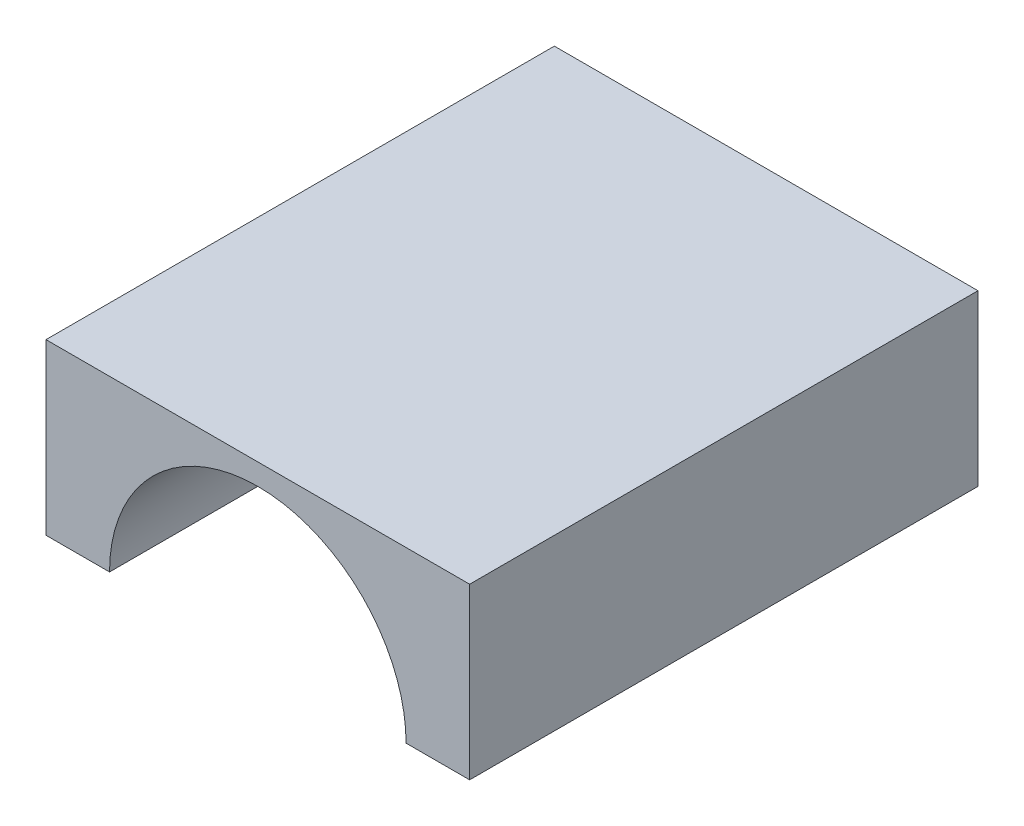
ISO-10303-21;
HEADER;
FILE_DESCRIPTION(('STEP AP214'),'2;1');
FILE_NAME('part.step','',(''),(''),'','','');
FILE_SCHEMA(('AUTOMOTIVE_DESIGN { 1 0 10303 214 1 1 1 1 }'));
ENDSEC;
DATA;
#1=APPLICATION_CONTEXT('core data for automotive mechanical design processes');
#2=APPLICATION_PROTOCOL_DEFINITION('international standard','automotive_design',2000,#1);
#3=PRODUCT_CONTEXT('',#1,'mechanical');
#4=PRODUCT('Part','Part','',(#3));
#5=PRODUCT_RELATED_PRODUCT_CATEGORY('part','',(#4));
#6=PRODUCT_DEFINITION_FORMATION('','',#4);
#7=PRODUCT_DEFINITION_CONTEXT('part definition',#1,'design');
#8=PRODUCT_DEFINITION('design','',#6,#7);
#9=PRODUCT_DEFINITION_SHAPE('','',#8);
#10=(LENGTH_UNIT() NAMED_UNIT(*) SI_UNIT(.MILLI.,.METRE.));
#11=(NAMED_UNIT(*) PLANE_ANGLE_UNIT() SI_UNIT($,.RADIAN.));
#12=(NAMED_UNIT(*) SI_UNIT($,.STERADIAN.) SOLID_ANGLE_UNIT());
#13=UNCERTAINTY_MEASURE_WITH_UNIT(LENGTH_MEASURE(1.E-05),#10,'distance_accuracy_value','');
#14=(GEOMETRIC_REPRESENTATION_CONTEXT(3) GLOBAL_UNCERTAINTY_ASSIGNED_CONTEXT((#13)) GLOBAL_UNIT_ASSIGNED_CONTEXT((#10,
#11,#12)) REPRESENTATION_CONTEXT('',''));
#15=CARTESIAN_POINT('',(0.,0.,0.));
#16=DIRECTION('',(0.,0.,1.));
#17=DIRECTION('',(1.,0.,0.));
#18=AXIS2_PLACEMENT_3D('',#15,#16,#17);
#19=CARTESIAN_POINT('',(0.,0.,0.));
#20=DIRECTION('',(0.,-1.,0.));
#21=DIRECTION('',(0.,0.,-1.));
#22=AXIS2_PLACEMENT_3D('',#19,#20,#21);
#23=PLANE('',#22);
#24=DIRECTION('',(0.,0.,-1.));
#25=VECTOR('',#24,1.);
#26=CARTESIAN_POINT('',(-7.,0.,-10.));
#27=LINE('',#26,#25);
#28=CARTESIAN_POINT('',(-7.,0.,-10.));
#29=VERTEX_POINT('',#28);
#30=CARTESIAN_POINT('',(-7.,0.,-12.));
#31=VERTEX_POINT('',#30);
#32=EDGE_CURVE('E192',#29,#31,#27,.T.);
#33=ORIENTED_EDGE('',*,*,#32,.F.);
#34=DIRECTION('',(0.,0.,1.));
#35=VECTOR('',#34,1.);
#36=CARTESIAN_POINT('',(-7.,0.,-10.));
#37=LINE('',#36,#35);
#38=CARTESIAN_POINT('',(-7.,0.,12.));
#39=VERTEX_POINT('',#38);
#40=EDGE_CURVE('E48',#39,#29,#37,.F.);
#41=ORIENTED_EDGE('',*,*,#40,.F.);
#42=DIRECTION('',(1.,0.,0.));
#43=VECTOR('',#42,1.);
#44=CARTESIAN_POINT('',(-10.,0.,12.));
#45=LINE('',#44,#43);
#46=CARTESIAN_POINT('',(-10.,0.,12.));
#47=VERTEX_POINT('',#46);
#48=EDGE_CURVE('E205',#47,#39,#45,.T.);
#49=ORIENTED_EDGE('',*,*,#48,.F.);
#50=DIRECTION('',(0.,0.,1.));
#51=VECTOR('',#50,1.);
#52=CARTESIAN_POINT('',(-10.,0.,12.));
#53=LINE('',#52,#51);
#54=CARTESIAN_POINT('',(-10.,0.,-12.));
#55=VERTEX_POINT('',#54);
#56=EDGE_CURVE('E222',#55,#47,#53,.T.);
#57=ORIENTED_EDGE('',*,*,#56,.F.);
#58=DIRECTION('',(-1.,0.,0.));
#59=VECTOR('',#58,1.);
#60=CARTESIAN_POINT('',(-10.,0.,-12.));
#61=LINE('',#60,#59);
#62=EDGE_CURVE('E217',#31,#55,#61,.T.);
#63=ORIENTED_EDGE('',*,*,#62,.F.);
#64=EDGE_LOOP('',(#33,#41,#49,#57,#63));
#65=FACE_BOUND('',#64,.T.);
#66=ADVANCED_FACE('F39',(#65),#23,.T.);
#67=CARTESIAN_POINT('',(10.,8.,12.));
#68=DIRECTION('',(-1.,0.,0.));
#69=DIRECTION('',(0.,0.,1.));
#70=AXIS2_PLACEMENT_3D('',#67,#68,#69);
#71=PLANE('',#70);
#72=DIRECTION('',(0.,0.,-1.));
#73=VECTOR('',#72,1.);
#74=CARTESIAN_POINT('',(10.,0.,12.));
#75=LINE('',#74,#73);
#76=CARTESIAN_POINT('',(10.,0.,12.));
#77=VERTEX_POINT('',#76);
#78=CARTESIAN_POINT('',(10.,0.,-12.));
#79=VERTEX_POINT('',#78);
#80=EDGE_CURVE('E199',#77,#79,#75,.T.);
#81=ORIENTED_EDGE('',*,*,#80,.T.);
#82=DIRECTION('',(0.,-1.,0.));
#83=VECTOR('',#82,1.);
#84=CARTESIAN_POINT('',(10.,8.,-12.));
#85=LINE('',#84,#83);
#86=CARTESIAN_POINT('',(10.,8.,-12.));
#87=VERTEX_POINT('',#86);
#88=EDGE_CURVE('E238',#87,#79,#85,.T.);
#89=ORIENTED_EDGE('',*,*,#88,.F.);
#90=DIRECTION('',(0.,0.,-1.));
#91=VECTOR('',#90,1.);
#92=CARTESIAN_POINT('',(10.,8.,12.));
#93=LINE('',#92,#91);
#94=CARTESIAN_POINT('',(10.,8.,12.));
#95=VERTEX_POINT('',#94);
#96=EDGE_CURVE('E202',#95,#87,#93,.T.);
#97=ORIENTED_EDGE('',*,*,#96,.F.);
#98=DIRECTION('',(0.,-1.,0.));
#99=VECTOR('',#98,1.);
#100=CARTESIAN_POINT('',(10.,8.,12.));
#101=LINE('',#100,#99);
#102=EDGE_CURVE('E213',#95,#77,#101,.T.);
#103=ORIENTED_EDGE('',*,*,#102,.T.);
#104=EDGE_LOOP('',(#81,#89,#97,#103));
#105=FACE_BOUND('',#104,.T.);
#106=ADVANCED_FACE('F41',(#105),#71,.F.);
#107=CARTESIAN_POINT('',(-10.,8.,-12.));
#108=DIRECTION('',(0.,0.,1.));
#109=DIRECTION('',(1.,0.,0.));
#110=AXIS2_PLACEMENT_3D('',#107,#108,#109);
#111=PLANE('',#110);
#112=CARTESIAN_POINT('',(7.,0.,-12.));
#113=VERTEX_POINT('',#112);
#114=EDGE_CURVE('E218',#79,#113,#61,.T.);
#115=ORIENTED_EDGE('',*,*,#114,.T.);
#116=CARTESIAN_POINT('',(0.,0.,-12.));
#117=DIRECTION('',(0.,0.,-1.));
#118=DIRECTION('',(-1.,0.,0.));
#119=AXIS2_PLACEMENT_3D('',#116,#117,#118);
#120=CIRCLE('',#119,7.);
#121=CARTESIAN_POINT('',(2.,-6.70820393249937,-12.));
#122=VERTEX_POINT('',#121);
#123=EDGE_CURVE('E173',#113,#122,#120,.T.);
#124=ORIENTED_EDGE('',*,*,#123,.T.);
#125=DIRECTION('',(0.,1.,0.));
#126=VECTOR('',#125,1.);
#127=CARTESIAN_POINT('',(2.,-6.70820393249937,-12.));
#128=LINE('',#127,#126);
#129=CARTESIAN_POINT('',(2.,-5.,-12.));
#130=VERTEX_POINT('',#129);
#131=EDGE_CURVE('E152',#122,#130,#128,.T.);
#132=ORIENTED_EDGE('',*,*,#131,.T.);
#133=DIRECTION('',(-1.,0.,0.));
#134=VECTOR('',#133,1.);
#135=CARTESIAN_POINT('',(2.,-5.,-12.));
#136=LINE('',#135,#134);
#137=CARTESIAN_POINT('',(-2.,-5.,-12.));
#138=VERTEX_POINT('',#137);
#139=EDGE_CURVE('E176',#130,#138,#136,.T.);
#140=ORIENTED_EDGE('',*,*,#139,.T.);
#141=DIRECTION('',(0.,-1.,0.));
#142=VECTOR('',#141,1.);
#143=CARTESIAN_POINT('',(-2.,-6.70820393249937,-12.));
#144=LINE('',#143,#142);
#145=CARTESIAN_POINT('',(-2.,-6.70820393249937,-12.));
#146=VERTEX_POINT('',#145);
#147=EDGE_CURVE('E145',#138,#146,#144,.T.);
#148=ORIENTED_EDGE('',*,*,#147,.T.);
#149=EDGE_CURVE('E55',#146,#31,#120,.T.);
#150=ORIENTED_EDGE('',*,*,#149,.T.);
#151=ORIENTED_EDGE('',*,*,#62,.T.);
#152=DIRECTION('',(0.,-1.,0.));
#153=VECTOR('',#152,1.);
#154=CARTESIAN_POINT('',(-10.,8.,-12.));
#155=LINE('',#154,#153);
#156=CARTESIAN_POINT('',(-10.,8.,-12.));
#157=VERTEX_POINT('',#156);
#158=EDGE_CURVE('E234',#157,#55,#155,.T.);
#159=ORIENTED_EDGE('',*,*,#158,.F.);
#160=DIRECTION('',(-1.,0.,0.));
#161=VECTOR('',#160,1.);
#162=CARTESIAN_POINT('',(-10.,8.,-12.));
#163=LINE('',#162,#161);
#164=EDGE_CURVE('E91',#87,#157,#163,.T.);
#165=ORIENTED_EDGE('',*,*,#164,.F.);
#166=ORIENTED_EDGE('',*,*,#88,.T.);
#167=EDGE_LOOP('',(#115,#124,#132,#140,#148,#150,#151,#159,#165,#166));
#168=FACE_BOUND('',#167,.T.);
#169=ADVANCED_FACE('F258',(#168),#111,.F.);
#170=CARTESIAN_POINT('',(-10.,8.,12.));
#171=DIRECTION('',(1.,0.,0.));
#172=DIRECTION('',(0.,0.,-1.));
#173=AXIS2_PLACEMENT_3D('',#170,#171,#172);
#174=PLANE('',#173);
#175=ORIENTED_EDGE('',*,*,#56,.T.);
#176=DIRECTION('',(0.,-1.,0.));
#177=VECTOR('',#176,1.);
#178=CARTESIAN_POINT('',(-10.,8.,12.));
#179=LINE('',#178,#177);
#180=CARTESIAN_POINT('',(-10.,8.,12.));
#181=VERTEX_POINT('',#180);
#182=EDGE_CURVE('E230',#181,#47,#179,.T.);
#183=ORIENTED_EDGE('',*,*,#182,.F.);
#184=DIRECTION('',(0.,0.,1.));
#185=VECTOR('',#184,1.);
#186=CARTESIAN_POINT('',(-10.,8.,12.));
#187=LINE('',#186,#185);
#188=EDGE_CURVE('E208',#157,#181,#187,.T.);
#189=ORIENTED_EDGE('',*,*,#188,.F.);
#190=ORIENTED_EDGE('',*,*,#158,.T.);
#191=EDGE_LOOP('',(#175,#183,#189,#190));
#192=FACE_BOUND('',#191,.T.);
#193=ADVANCED_FACE('F255',(#192),#174,.F.);
#194=CARTESIAN_POINT('',(-10.,8.,12.));
#195=DIRECTION('',(0.,0.,-1.));
#196=DIRECTION('',(-1.,0.,0.));
#197=AXIS2_PLACEMENT_3D('',#194,#195,#196);
#198=PLANE('',#197);
#199=ORIENTED_EDGE('',*,*,#48,.T.);
#200=CARTESIAN_POINT('',(0.,0.,12.));
#201=DIRECTION('',(0.,0.,1.));
#202=DIRECTION('',(1.,0.,0.));
#203=AXIS2_PLACEMENT_3D('',#200,#201,#202);
#204=CIRCLE('',#203,7.);
#205=CARTESIAN_POINT('',(7.,0.,12.));
#206=VERTEX_POINT('',#205);
#207=EDGE_CURVE('E195',#206,#39,#204,.T.);
#208=ORIENTED_EDGE('',*,*,#207,.F.);
#209=EDGE_CURVE('E84',#206,#77,#45,.T.);
#210=ORIENTED_EDGE('',*,*,#209,.T.);
#211=ORIENTED_EDGE('',*,*,#102,.F.);
#212=DIRECTION('',(1.,0.,0.));
#213=VECTOR('',#212,1.);
#214=CARTESIAN_POINT('',(-10.,8.,12.));
#215=LINE('',#214,#213);
#216=EDGE_CURVE('E64',#181,#95,#215,.T.);
#217=ORIENTED_EDGE('',*,*,#216,.F.);
#218=ORIENTED_EDGE('',*,*,#182,.T.);
#219=EDGE_LOOP('',(#199,#208,#210,#211,#217,#218));
#220=FACE_BOUND('',#219,.T.);
#221=ADVANCED_FACE('F251',(#220),#198,.F.);
#222=CARTESIAN_POINT('',(0.,8.,0.));
#223=DIRECTION('',(0.,-1.,0.));
#224=DIRECTION('',(0.,0.,-1.));
#225=AXIS2_PLACEMENT_3D('',#222,#223,#224);
#226=PLANE('',#225);
#227=ORIENTED_EDGE('',*,*,#96,.T.);
#228=ORIENTED_EDGE('',*,*,#164,.T.);
#229=ORIENTED_EDGE('',*,*,#188,.T.);
#230=ORIENTED_EDGE('',*,*,#216,.T.);
#231=EDGE_LOOP('',(#227,#228,#229,#230));
#232=FACE_BOUND('',#231,.T.);
#233=ADVANCED_FACE('F274',(#232),#226,.F.);
#234=DIRECTION('',(0.,0.,-1.));
#235=VECTOR('',#234,1.);
#236=CARTESIAN_POINT('',(7.,0.,-10.));
#237=LINE('',#236,#235);
#238=CARTESIAN_POINT('',(7.,0.,-10.));
#239=VERTEX_POINT('',#238);
#240=EDGE_CURVE('E138',#113,#239,#237,.F.);
#241=ORIENTED_EDGE('',*,*,#240,.F.);
#242=ORIENTED_EDGE('',*,*,#114,.F.);
#243=ORIENTED_EDGE('',*,*,#80,.F.);
#244=ORIENTED_EDGE('',*,*,#209,.F.);
#245=DIRECTION('',(0.,0.,1.));
#246=VECTOR('',#245,1.);
#247=CARTESIAN_POINT('',(7.,0.,-10.));
#248=LINE('',#247,#246);
#249=EDGE_CURVE('E11',#239,#206,#248,.T.);
#250=ORIENTED_EDGE('',*,*,#249,.F.);
#251=EDGE_LOOP('',(#241,#242,#243,#244,#250));
#252=FACE_BOUND('',#251,.T.);
#253=ADVANCED_FACE('F268',(#252),#23,.T.);
#254=CARTESIAN_POINT('',(0.,0.,-10.));
#255=DIRECTION('',(0.,0.,1.));
#256=DIRECTION('',(1.,0.,0.));
#257=AXIS2_PLACEMENT_3D('',#254,#255,#256);
#258=CYLINDRICAL_SURFACE('',#257,7.);
#259=ORIENTED_EDGE('',*,*,#249,.T.);
#260=ORIENTED_EDGE('',*,*,#207,.T.);
#261=ORIENTED_EDGE('',*,*,#40,.T.);
#262=CARTESIAN_POINT('',(0.,0.,-10.));
#263=DIRECTION('',(0.,0.,1.));
#264=DIRECTION('',(1.,0.,0.));
#265=AXIS2_PLACEMENT_3D('',#262,#263,#264);
#266=CIRCLE('',#265,7.);
#267=EDGE_CURVE('E196',#239,#29,#266,.T.);
#268=ORIENTED_EDGE('',*,*,#267,.F.);
#269=EDGE_LOOP('',(#259,#260,#261,#268));
#270=FACE_BOUND('',#269,.T.);
#271=ADVANCED_FACE('F244',(#270),#258,.F.);
#272=CARTESIAN_POINT('',(0.,0.,-10.));
#273=DIRECTION('',(0.,0.,1.));
#274=DIRECTION('',(1.,0.,0.));
#275=AXIS2_PLACEMENT_3D('',#272,#273,#274);
#276=PLANE('',#275);
#277=ORIENTED_EDGE('',*,*,#267,.T.);
#278=CARTESIAN_POINT('',(0.,0.,-10.));
#279=DIRECTION('',(0.,0.,-1.));
#280=DIRECTION('',(-1.,0.,0.));
#281=AXIS2_PLACEMENT_3D('',#278,#279,#280);
#282=CIRCLE('',#281,7.);
#283=CARTESIAN_POINT('',(-2.,-6.70820393249937,-10.));
#284=VERTEX_POINT('',#283);
#285=EDGE_CURVE('E144',#284,#29,#282,.T.);
#286=ORIENTED_EDGE('',*,*,#285,.F.);
#287=DIRECTION('',(0.,-1.,0.));
#288=VECTOR('',#287,1.);
#289=CARTESIAN_POINT('',(-2.,-6.70820393249937,-10.));
#290=LINE('',#289,#288);
#291=CARTESIAN_POINT('',(-2.,-5.,-10.));
#292=VERTEX_POINT('',#291);
#293=EDGE_CURVE('E155',#292,#284,#290,.T.);
#294=ORIENTED_EDGE('',*,*,#293,.F.);
#295=DIRECTION('',(-1.,0.,0.));
#296=VECTOR('',#295,1.);
#297=CARTESIAN_POINT('',(2.,-5.,-10.));
#298=LINE('',#297,#296);
#299=CARTESIAN_POINT('',(2.,-5.,-10.));
#300=VERTEX_POINT('',#299);
#301=EDGE_CURVE('E161',#300,#292,#298,.T.);
#302=ORIENTED_EDGE('',*,*,#301,.F.);
#303=DIRECTION('',(0.,1.,0.));
#304=VECTOR('',#303,1.);
#305=CARTESIAN_POINT('',(2.,-6.70820393249937,-10.));
#306=LINE('',#305,#304);
#307=CARTESIAN_POINT('',(2.,-6.70820393249937,-10.));
#308=VERTEX_POINT('',#307);
#309=EDGE_CURVE('E150',#308,#300,#306,.T.);
#310=ORIENTED_EDGE('',*,*,#309,.F.);
#311=EDGE_CURVE('E132',#239,#308,#282,.T.);
#312=ORIENTED_EDGE('',*,*,#311,.F.);
#313=EDGE_LOOP('',(#277,#286,#294,#302,#310,#312));
#314=FACE_BOUND('',#313,.T.);
#315=ADVANCED_FACE('F158',(#314),#276,.T.);
#316=CARTESIAN_POINT('',(0.,0.,-10.));
#317=DIRECTION('',(0.,0.,-1.));
#318=DIRECTION('',(-1.,0.,0.));
#319=AXIS2_PLACEMENT_3D('',#316,#317,#318);
#320=CYLINDRICAL_SURFACE('',#319,7.);
#321=ORIENTED_EDGE('',*,*,#285,.T.);
#322=ORIENTED_EDGE('',*,*,#32,.T.);
#323=ORIENTED_EDGE('',*,*,#149,.F.);
#324=DIRECTION('',(0.,0.,-1.));
#325=VECTOR('',#324,1.);
#326=CARTESIAN_POINT('',(-2.,-6.70820393249937,-10.));
#327=LINE('',#326,#325);
#328=EDGE_CURVE('E182',#284,#146,#327,.T.);
#329=ORIENTED_EDGE('',*,*,#328,.F.);
#330=EDGE_LOOP('',(#321,#322,#323,#329));
#331=FACE_BOUND('',#330,.T.);
#332=ADVANCED_FACE('F290',(#331),#320,.T.);
#333=ORIENTED_EDGE('',*,*,#123,.F.);
#334=ORIENTED_EDGE('',*,*,#240,.T.);
#335=ORIENTED_EDGE('',*,*,#311,.T.);
#336=DIRECTION('',(0.,0.,-1.));
#337=VECTOR('',#336,1.);
#338=CARTESIAN_POINT('',(2.,-6.70820393249937,-10.));
#339=LINE('',#338,#337);
#340=EDGE_CURVE('E135',#308,#122,#339,.T.);
#341=ORIENTED_EDGE('',*,*,#340,.T.);
#342=EDGE_LOOP('',(#333,#334,#335,#341));
#343=FACE_BOUND('',#342,.T.);
#344=ADVANCED_FACE('F134',(#343),#320,.T.);
#345=CARTESIAN_POINT('',(-2.,-6.70820393249937,-10.));
#346=DIRECTION('',(1.,0.,0.));
#347=DIRECTION('',(0.,0.,-1.));
#348=AXIS2_PLACEMENT_3D('',#345,#346,#347);
#349=PLANE('',#348);
#350=ORIENTED_EDGE('',*,*,#147,.F.);
#351=DIRECTION('',(0.,0.,-1.));
#352=VECTOR('',#351,1.);
#353=CARTESIAN_POINT('',(-2.,-5.,-10.));
#354=LINE('',#353,#352);
#355=EDGE_CURVE('E185',#292,#138,#354,.T.);
#356=ORIENTED_EDGE('',*,*,#355,.F.);
#357=ORIENTED_EDGE('',*,*,#293,.T.);
#358=ORIENTED_EDGE('',*,*,#328,.T.);
#359=EDGE_LOOP('',(#350,#356,#357,#358));
#360=FACE_BOUND('',#359,.T.);
#361=ADVANCED_FACE('F293',(#360),#349,.T.);
#362=CARTESIAN_POINT('',(2.,-5.,-10.));
#363=DIRECTION('',(0.,-1.,0.));
#364=DIRECTION('',(0.,0.,-1.));
#365=AXIS2_PLACEMENT_3D('',#362,#363,#364);
#366=PLANE('',#365);
#367=ORIENTED_EDGE('',*,*,#139,.F.);
#368=DIRECTION('',(0.,0.,-1.));
#369=VECTOR('',#368,1.);
#370=CARTESIAN_POINT('',(2.,-5.,-10.));
#371=LINE('',#370,#369);
#372=EDGE_CURVE('E154',#300,#130,#371,.T.);
#373=ORIENTED_EDGE('',*,*,#372,.F.);
#374=ORIENTED_EDGE('',*,*,#301,.T.);
#375=ORIENTED_EDGE('',*,*,#355,.T.);
#376=EDGE_LOOP('',(#367,#373,#374,#375));
#377=FACE_BOUND('',#376,.T.);
#378=ADVANCED_FACE('F296',(#377),#366,.T.);
#379=CARTESIAN_POINT('',(2.,-6.70820393249937,-10.));
#380=DIRECTION('',(-1.,0.,0.));
#381=DIRECTION('',(0.,0.,1.));
#382=AXIS2_PLACEMENT_3D('',#379,#380,#381);
#383=PLANE('',#382);
#384=ORIENTED_EDGE('',*,*,#131,.F.);
#385=ORIENTED_EDGE('',*,*,#340,.F.);
#386=ORIENTED_EDGE('',*,*,#309,.T.);
#387=ORIENTED_EDGE('',*,*,#372,.T.);
#388=EDGE_LOOP('',(#384,#385,#386,#387));
#389=FACE_BOUND('',#388,.T.);
#390=ADVANCED_FACE('F149',(#389),#383,.T.);
#391=CLOSED_SHELL('',(#66,#106,#169,#193,#221,#233,#253,#271,#315,#332,#344,#361,#378,#390));
#392=MANIFOLD_SOLID_BREP('B2',#391);
#393=ADVANCED_BREP_SHAPE_REPRESENTATION('',(#18,#392),#14);
#394=SHAPE_DEFINITION_REPRESENTATION(#9,#393);
ENDSEC;
END-ISO-10303-21;
